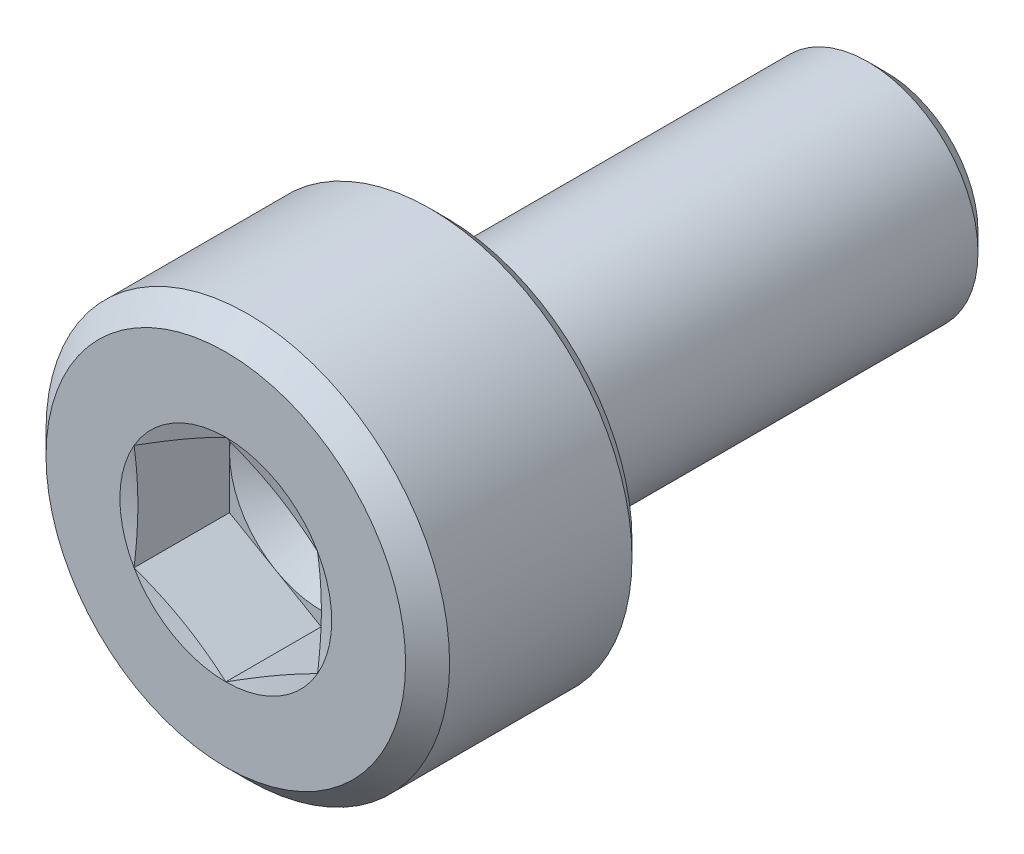
ISO-10303-21;
HEADER;
FILE_DESCRIPTION(('STEP AP214'),'2;1');
FILE_NAME('part.step','',(''),(''),'','','');
FILE_SCHEMA(('AUTOMOTIVE_DESIGN { 1 0 10303 214 1 1 1 1 }'));
ENDSEC;
DATA;
#1=APPLICATION_CONTEXT('core data for automotive mechanical design processes');
#2=APPLICATION_PROTOCOL_DEFINITION('international standard','automotive_design',2000,#1);
#3=PRODUCT_CONTEXT('',#1,'mechanical');
#4=PRODUCT('Part','Part','',(#3));
#5=PRODUCT_RELATED_PRODUCT_CATEGORY('part','',(#4));
#6=PRODUCT_DEFINITION_FORMATION('','',#4);
#7=PRODUCT_DEFINITION_CONTEXT('part definition',#1,'design');
#8=PRODUCT_DEFINITION('design','',#6,#7);
#9=PRODUCT_DEFINITION_SHAPE('','',#8);
#10=(LENGTH_UNIT() NAMED_UNIT(*) SI_UNIT(.MILLI.,.METRE.));
#11=(NAMED_UNIT(*) PLANE_ANGLE_UNIT() SI_UNIT($,.RADIAN.));
#12=(NAMED_UNIT(*) SI_UNIT($,.STERADIAN.) SOLID_ANGLE_UNIT());
#13=UNCERTAINTY_MEASURE_WITH_UNIT(LENGTH_MEASURE(1.E-05),#10,'distance_accuracy_value','');
#14=(GEOMETRIC_REPRESENTATION_CONTEXT(3) GLOBAL_UNCERTAINTY_ASSIGNED_CONTEXT((#13)) GLOBAL_UNIT_ASSIGNED_CONTEXT((#10,
#11,#12)) REPRESENTATION_CONTEXT('',''));
#15=CARTESIAN_POINT('',(0.,0.,0.));
#16=DIRECTION('',(0.,0.,1.));
#17=DIRECTION('',(1.,0.,0.));
#18=AXIS2_PLACEMENT_3D('',#15,#16,#17);
#19=CARTESIAN_POINT('',(0.,0.,0.));
#20=DIRECTION('',(0.,0.,-1.));
#21=DIRECTION('',(-1.,0.,0.));
#22=AXIS2_PLACEMENT_3D('',#19,#20,#21);
#23=PLANE('',#22);
#24=CARTESIAN_POINT('',(0.,0.,0.));
#25=DIRECTION('',(0.,0.,1.));
#26=DIRECTION('',(1.,0.,0.));
#27=AXIS2_PLACEMENT_3D('',#24,#25,#26);
#28=CIRCLE('',#27,2.44999999999999);
#29=CARTESIAN_POINT('',(2.44999999999999,0.,0.));
#30=VERTEX_POINT('',#29);
#31=EDGE_CURVE('E227',#30,#30,#28,.T.);
#32=ORIENTED_EDGE('',*,*,#31,.T.);
#33=EDGE_LOOP('',(#32));
#34=FACE_BOUND('',#33,.T.);
#35=CARTESIAN_POINT('',(0.,0.,0.));
#36=DIRECTION('',(0.,0.,1.));
#37=DIRECTION('',(1.,0.,0.));
#38=AXIS2_PLACEMENT_3D('',#35,#36,#37);
#39=CIRCLE('',#38,1.44337567297407);
#40=CARTESIAN_POINT('',(-1.25,-0.721687836487033,0.));
#41=VERTEX_POINT('',#40);
#42=CARTESIAN_POINT('',(0.,-1.44337567297407,0.));
#43=VERTEX_POINT('',#42);
#44=EDGE_CURVE('E153',#41,#43,#39,.T.);
#45=ORIENTED_EDGE('',*,*,#44,.F.);
#46=CARTESIAN_POINT('',(-1.25,0.721687836487033,0.));
#47=VERTEX_POINT('',#46);
#48=EDGE_CURVE('E152',#47,#41,#39,.T.);
#49=ORIENTED_EDGE('',*,*,#48,.F.);
#50=CARTESIAN_POINT('',(0.,1.44337567297407,0.));
#51=VERTEX_POINT('',#50);
#52=EDGE_CURVE('E119',#51,#47,#39,.T.);
#53=ORIENTED_EDGE('',*,*,#52,.F.);
#54=CARTESIAN_POINT('',(1.25,0.721687836487034,0.));
#55=VERTEX_POINT('',#54);
#56=EDGE_CURVE('E113',#55,#51,#39,.T.);
#57=ORIENTED_EDGE('',*,*,#56,.F.);
#58=CARTESIAN_POINT('',(1.25,-0.721687836487031,0.));
#59=VERTEX_POINT('',#58);
#60=EDGE_CURVE('E121',#59,#55,#39,.T.);
#61=ORIENTED_EDGE('',*,*,#60,.F.);
#62=EDGE_CURVE('E311',#43,#59,#39,.T.);
#63=ORIENTED_EDGE('',*,*,#62,.F.);
#64=EDGE_LOOP('',(#45,#49,#53,#57,#61,#63));
#65=FACE_BOUND('',#64,.T.);
#66=ADVANCED_FACE('F36',(#34,#65),#23,.F.);
#67=CARTESIAN_POINT('',(0.,0.,-0.3));
#68=DIRECTION('',(0.,0.,-1.));
#69=DIRECTION('',(-1.,0.,0.));
#70=AXIS2_PLACEMENT_3D('',#67,#68,#69);
#71=CONICAL_SURFACE('',#70,2.75,0.78539816339746);
#72=ORIENTED_EDGE('',*,*,#31,.F.);
#73=EDGE_LOOP('',(#72));
#74=FACE_BOUND('',#73,.T.);
#75=CARTESIAN_POINT('',(0.,0.,-0.3));
#76=DIRECTION('',(0.,0.,1.));
#77=DIRECTION('',(1.,0.,0.));
#78=AXIS2_PLACEMENT_3D('',#75,#76,#77);
#79=CIRCLE('',#78,2.75);
#80=CARTESIAN_POINT('',(2.75,0.,-0.3));
#81=VERTEX_POINT('',#80);
#82=EDGE_CURVE('E229',#81,#81,#79,.T.);
#83=ORIENTED_EDGE('',*,*,#82,.T.);
#84=EDGE_LOOP('',(#83));
#85=FACE_BOUND('',#84,.T.);
#86=ADVANCED_FACE('F218',(#74,#85),#71,.T.);
#87=CARTESIAN_POINT('',(0.,0.,0.));
#88=DIRECTION('',(0.,0.,1.));
#89=DIRECTION('',(1.,0.,0.));
#90=AXIS2_PLACEMENT_3D('',#87,#88,#89);
#91=CYLINDRICAL_SURFACE('',#90,2.75);
#92=ORIENTED_EDGE('',*,*,#82,.F.);
#93=EDGE_LOOP('',(#92));
#94=FACE_BOUND('',#93,.T.);
#95=CARTESIAN_POINT('',(0.,0.,-2.785));
#96=DIRECTION('',(0.,0.,1.));
#97=DIRECTION('',(1.,0.,0.));
#98=AXIS2_PLACEMENT_3D('',#95,#96,#97);
#99=CIRCLE('',#98,2.75);
#100=CARTESIAN_POINT('',(2.75,0.,-2.785));
#101=VERTEX_POINT('',#100);
#102=EDGE_CURVE('E232',#101,#101,#99,.T.);
#103=ORIENTED_EDGE('',*,*,#102,.T.);
#104=EDGE_LOOP('',(#103));
#105=FACE_BOUND('',#104,.T.);
#106=ADVANCED_FACE('F223',(#94,#105),#91,.T.);
#107=CARTESIAN_POINT('',(0.,0.,-3.));
#108=DIRECTION('',(0.,0.,1.));
#109=DIRECTION('',(1.,0.,0.));
#110=AXIS2_PLACEMENT_3D('',#107,#108,#109);
#111=CONICAL_SURFACE('',#110,2.535,0.785398163397449);
#112=ORIENTED_EDGE('',*,*,#102,.F.);
#113=EDGE_LOOP('',(#112));
#114=FACE_BOUND('',#113,.T.);
#115=CARTESIAN_POINT('',(0.,0.,-3.));
#116=DIRECTION('',(0.,0.,1.));
#117=DIRECTION('',(1.,0.,0.));
#118=AXIS2_PLACEMENT_3D('',#115,#116,#117);
#119=CIRCLE('',#118,2.535);
#120=CARTESIAN_POINT('',(2.535,0.,-3.));
#121=VERTEX_POINT('',#120);
#122=EDGE_CURVE('E237',#121,#121,#119,.T.);
#123=ORIENTED_EDGE('',*,*,#122,.T.);
#124=EDGE_LOOP('',(#123));
#125=FACE_BOUND('',#124,.T.);
#126=ADVANCED_FACE('F427',(#114,#125),#111,.T.);
#127=CARTESIAN_POINT('',(0.,2.535,-3.));
#128=DIRECTION('',(0.,0.,1.));
#129=DIRECTION('',(1.,0.,0.));
#130=AXIS2_PLACEMENT_3D('',#127,#128,#129);
#131=PLANE('',#130);
#132=ORIENTED_EDGE('',*,*,#122,.F.);
#133=EDGE_LOOP('',(#132));
#134=FACE_BOUND('',#133,.T.);
#135=CARTESIAN_POINT('',(0.,0.,-3.));
#136=DIRECTION('',(0.,0.,1.));
#137=DIRECTION('',(1.,0.,0.));
#138=AXIS2_PLACEMENT_3D('',#135,#136,#137);
#139=CIRCLE('',#138,1.8);
#140=CARTESIAN_POINT('',(1.8,0.,-3.));
#141=VERTEX_POINT('',#140);
#142=EDGE_CURVE('E240',#141,#141,#139,.T.);
#143=ORIENTED_EDGE('',*,*,#142,.T.);
#144=EDGE_LOOP('',(#143));
#145=FACE_BOUND('',#144,.T.);
#146=ADVANCED_FACE('F419',(#134,#145),#131,.F.);
#147=CARTESIAN_POINT('',(0.,0.,-3.1));
#148=DIRECTION('',(0.,0.,1.));
#149=DIRECTION('',(1.,0.,0.));
#150=AXIS2_PLACEMENT_3D('',#147,#148,#149);
#151=TOROIDAL_SURFACE('',#150,1.8,0.1);
#152=ORIENTED_EDGE('',*,*,#142,.F.);
#153=EDGE_LOOP('',(#152));
#154=FACE_BOUND('',#153,.T.);
#155=CARTESIAN_POINT('',(0.,0.,-3.05615763679786));
#156=DIRECTION('',(0.,0.,1.));
#157=DIRECTION('',(1.,0.,0.));
#158=AXIS2_PLACEMENT_3D('',#155,#156,#157);
#159=CIRCLE('',#158,1.71012315543561);
#160=CARTESIAN_POINT('',(1.71012315543561,0.,-3.05615763679786));
#161=VERTEX_POINT('',#160);
#162=EDGE_CURVE('E243',#161,#161,#159,.T.);
#163=ORIENTED_EDGE('',*,*,#162,.T.);
#164=EDGE_LOOP('',(#163));
#165=FACE_BOUND('',#164,.T.);
#166=ADVANCED_FACE('F411',(#154,#165),#151,.F.);
#167=CARTESIAN_POINT('',(0.,0.,-3.46615763679786));
#168=DIRECTION('',(0.,0.,1.));
#169=DIRECTION('',(1.,0.,0.));
#170=AXIS2_PLACEMENT_3D('',#167,#168,#169);
#171=CONICAL_SURFACE('',#170,1.51012315543561,0.453844001521511);
#172=ORIENTED_EDGE('',*,*,#162,.F.);
#173=EDGE_LOOP('',(#172));
#174=FACE_BOUND('',#173,.T.);
#175=CARTESIAN_POINT('',(0.,0.,-3.46615763679786));
#176=DIRECTION('',(0.,0.,1.));
#177=DIRECTION('',(1.,0.,0.));
#178=AXIS2_PLACEMENT_3D('',#175,#176,#177);
#179=CIRCLE('',#178,1.51012315543561);
#180=CARTESIAN_POINT('',(1.51012315543561,0.,-3.46615763679786));
#181=VERTEX_POINT('',#180);
#182=EDGE_CURVE('E246',#181,#181,#179,.T.);
#183=ORIENTED_EDGE('',*,*,#182,.T.);
#184=EDGE_LOOP('',(#183));
#185=FACE_BOUND('',#184,.T.);
#186=ADVANCED_FACE('F403',(#174,#185),#171,.T.);
#187=CARTESIAN_POINT('',(0.,0.,-3.51));
#188=DIRECTION('',(0.,0.,1.));
#189=DIRECTION('',(1.,0.,0.));
#190=AXIS2_PLACEMENT_3D('',#187,#188,#189);
#191=TOROIDAL_SURFACE('',#190,1.6,0.1);
#192=ORIENTED_EDGE('',*,*,#182,.F.);
#193=EDGE_LOOP('',(#192));
#194=FACE_BOUND('',#193,.T.);
#195=CARTESIAN_POINT('',(0.,0.,-3.51));
#196=DIRECTION('',(0.,0.,1.));
#197=DIRECTION('',(1.,0.,0.));
#198=AXIS2_PLACEMENT_3D('',#195,#196,#197);
#199=CIRCLE('',#198,1.5);
#200=CARTESIAN_POINT('',(1.5,0.,-3.51));
#201=VERTEX_POINT('',#200);
#202=EDGE_CURVE('E249',#201,#201,#199,.T.);
#203=ORIENTED_EDGE('',*,*,#202,.T.);
#204=EDGE_LOOP('',(#203));
#205=FACE_BOUND('',#204,.T.);
#206=ADVANCED_FACE('F395',(#194,#205),#191,.F.);
#207=CARTESIAN_POINT('',(0.,0.,0.));
#208=DIRECTION('',(0.,0.,1.));
#209=DIRECTION('',(1.,0.,0.));
#210=AXIS2_PLACEMENT_3D('',#207,#208,#209);
#211=CYLINDRICAL_SURFACE('',#210,1.5);
#212=ORIENTED_EDGE('',*,*,#202,.F.);
#213=EDGE_LOOP('',(#212));
#214=FACE_BOUND('',#213,.T.);
#215=CARTESIAN_POINT('',(0.,0.,-8.75));
#216=DIRECTION('',(0.,0.,1.));
#217=DIRECTION('',(1.,0.,0.));
#218=AXIS2_PLACEMENT_3D('',#215,#216,#217);
#219=CIRCLE('',#218,1.5);
#220=CARTESIAN_POINT('',(1.5,0.,-8.75));
#221=VERTEX_POINT('',#220);
#222=EDGE_CURVE('E252',#221,#221,#219,.T.);
#223=ORIENTED_EDGE('',*,*,#222,.T.);
#224=EDGE_LOOP('',(#223));
#225=FACE_BOUND('',#224,.T.);
#226=ADVANCED_FACE('F386',(#214,#225),#211,.T.);
#227=CARTESIAN_POINT('',(0.,0.,-9.));
#228=DIRECTION('',(0.,0.,1.));
#229=DIRECTION('',(1.,0.,0.));
#230=AXIS2_PLACEMENT_3D('',#227,#228,#229);
#231=CONICAL_SURFACE('',#230,1.25,0.785398163397438);
#232=ORIENTED_EDGE('',*,*,#222,.F.);
#233=EDGE_LOOP('',(#232));
#234=FACE_BOUND('',#233,.T.);
#235=CARTESIAN_POINT('',(0.,0.,-9.));
#236=DIRECTION('',(0.,0.,1.));
#237=DIRECTION('',(1.,0.,0.));
#238=AXIS2_PLACEMENT_3D('',#235,#236,#237);
#239=CIRCLE('',#238,1.25);
#240=CARTESIAN_POINT('',(1.25,0.,-9.));
#241=VERTEX_POINT('',#240);
#242=EDGE_CURVE('E255',#241,#241,#239,.T.);
#243=ORIENTED_EDGE('',*,*,#242,.T.);
#244=EDGE_LOOP('',(#243));
#245=FACE_BOUND('',#244,.T.);
#246=ADVANCED_FACE('F378',(#234,#245),#231,.T.);
#247=CARTESIAN_POINT('',(0.,1.25,-9.));
#248=DIRECTION('',(0.,0.,1.));
#249=DIRECTION('',(1.,0.,0.));
#250=AXIS2_PLACEMENT_3D('',#247,#248,#249);
#251=PLANE('',#250);
#252=ORIENTED_EDGE('',*,*,#242,.F.);
#253=EDGE_LOOP('',(#252));
#254=FACE_BOUND('',#253,.T.);
#255=ADVANCED_FACE('F372',(#254),#251,.F.);
#256=CARTESIAN_POINT('',(0.,0.,-0.0518148554092243));
#257=DIRECTION('',(0.,0.,1.));
#258=DIRECTION('',(1.,0.,0.));
#259=AXIS2_PLACEMENT_3D('',#256,#257,#258);
#260=CONICAL_SURFACE('',#259,1.25,1.30899693899575);
#261=ORIENTED_EDGE('',*,*,#52,.T.);
#262=CARTESIAN_POINT('',(-1.2502,0.721572366433195,3.09438201916871E-05));
#263=CARTESIAN_POINT('',(-1.19827409383526,0.751551802335321,-0.00800698378926622));
#264=CARTESIAN_POINT('',(-1.14625401362102,0.781585609650283,-0.0153042105125454));
#265=CARTESIAN_POINT('',(-1.04203006351459,0.841759335300235,-0.0281248924452036));
#266=CARTESIAN_POINT('',(-0.989826127596593,0.871899291755248,-0.0336476265269101));
#267=CARTESIAN_POINT('',(-0.88555111655682,0.932102497448812,-0.0425967858491088));
#268=CARTESIAN_POINT('',(-0.833480747184869,0.962165339222511,-0.0460338877791617));
#269=CARTESIAN_POINT('',(-0.729273575326724,1.0223293779463,-0.0506427032068));
#270=CARTESIAN_POINT('',(-0.677136787663362,1.05243056633842,-0.0518148554092241));
#271=CARTESIAN_POINT('',(-0.572863212336638,1.11263294312267,-0.0518148554092241));
#272=CARTESIAN_POINT('',(-0.520726424673275,1.1427341315148,-0.0506427032068001));
#273=CARTESIAN_POINT('',(-0.416519252815131,1.20289817023859,-0.0460338877791617));
#274=CARTESIAN_POINT('',(-0.36444888344318,1.23296101201229,-0.0425967858491088));
#275=CARTESIAN_POINT('',(-0.260173872403407,1.29316421770585,-0.03364762652691));
#276=CARTESIAN_POINT('',(-0.207969936485411,1.32330417416086,-0.0281248924452036));
#277=CARTESIAN_POINT('',(-0.103745986378985,1.38347789981082,-0.0153042105125453));
#278=CARTESIAN_POINT('',(-0.0517259061647358,1.41351170712578,-0.00800698378926612));
#279=CARTESIAN_POINT('',(0.00020000000000038,1.4434911430279,3.09438201918299E-05));
#280=B_SPLINE_CURVE_WITH_KNOTS('',3,(#262,#263,#264,#265,#266,#267,#268,#269,#270,#271,#272,
#273,#274,#275,#276,#277,#278,#279),.UNSPECIFIED.,.F.,.F.,(4,2,2,2,2,2,2,2,4),(0.,
0.18149525192516,0.363064167833313,0.543695584294992,0.724292010212745,0.9048884361305,
1.08551985259218,1.26708876850033,1.44858402042549),.UNSPECIFIED.);
#281=EDGE_CURVE('E11',#47,#51,#280,.T.);
#282=ORIENTED_EDGE('',*,*,#281,.T.);
#283=EDGE_LOOP('',(#261,#282));
#284=FACE_BOUND('',#283,.T.);
#285=ADVANCED_FACE('F125',(#284),#260,.F.);
#286=CARTESIAN_POINT('',(-1.25,-1.90803764372689,0.224449375411132));
#287=CARTESIAN_POINT('',(-1.25,-1.8513410457493,0.21174373926854));
#288=CARTESIAN_POINT('',(-1.25,-1.79460907964503,0.199195804458375));
#289=CARTESIAN_POINT('',(-1.25,-1.68105673477474,0.174495010900465));
#290=CARTESIAN_POINT('',(-1.25,-1.62423635229394,0.162342169249333));
#291=CARTESIAN_POINT('',(-1.25,-1.4535135757121,0.126574423752231));
#292=CARTESIAN_POINT('',(-1.25,-1.33945900339908,0.103675151182616));
#293=CARTESIAN_POINT('',(-1.25,-1.11170727260793,0.0609587630346281));
#294=CARTESIAN_POINT('',(-1.25,-0.998014548362105,0.0411184667683871));
#295=CARTESIAN_POINT('',(-1.25,-0.769948454688276,0.00583266905587686));
#296=CARTESIAN_POINT('',(-1.25,-0.655575207287998,-0.00961359741797872));
#297=CARTESIAN_POINT('',(-1.25,-0.424787181644499,-0.0341426384914952));
#298=CARTESIAN_POINT('',(-1.25,-0.308363938645654,-0.0431515305449703));
#299=CARTESIAN_POINT('',(-1.25,-0.133499226938177,-0.0502674214127566));
#300=CARTESIAN_POINT('',(-1.25,-0.0751823293286765,-0.0515734559811251));
#301=CARTESIAN_POINT('',(-1.25,0.0414593912908041,-0.0519953132862497));
#302=CARTESIAN_POINT('',(-1.25,0.0997842142946219,-0.0511111377164467));
#303=CARTESIAN_POINT('',(-1.25,0.275064939261687,-0.0452058780708578));
#304=CARTESIAN_POINT('',(-1.25,0.391917619612776,-0.0369155048717787));
#305=CARTESIAN_POINT('',(-1.25,0.624955711707257,-0.013420604100275));
#306=CARTESIAN_POINT('',(-1.25,0.741140574853819,0.00178895996036897));
#307=CARTESIAN_POINT('',(-1.25,0.965009686747211,0.0357098573203466));
#308=CARTESIAN_POINT('',(-1.25,1.07274149713457,0.0541179629895213));
#309=CARTESIAN_POINT('',(-1.25,1.28770836040789,0.0936619087242774));
#310=CARTESIAN_POINT('',(-1.25,1.39494334881407,0.114798093117207));
#311=CARTESIAN_POINT('',(-1.25,1.60905523406172,0.158897571848756));
#312=CARTESIAN_POINT('',(-1.25,1.71593205434096,0.181861233731142));
#313=CARTESIAN_POINT('',(-1.25,1.92941059122614,0.229035853527515));
#314=CARTESIAN_POINT('',(-1.25,2.0360123020935,0.253246837242345));
#315=CARTESIAN_POINT('',(-1.25,2.24796149236902,0.302300913060499));
#316=CARTESIAN_POINT('',(-1.25,2.35331096915779,0.32713541151495));
#317=CARTESIAN_POINT('',(-1.25,2.56386296226419,0.377426560036597));
#318=CARTESIAN_POINT('',(-1.25,2.66906547587909,0.402883221390532));
#319=CARTESIAN_POINT('',(-1.25,2.87922866754162,0.454224569867166));
#320=CARTESIAN_POINT('',(-1.25,2.98418948388924,0.4801086920956));
#321=CARTESIAN_POINT('',(-1.25,3.19401964928918,0.53223064686748));
#322=CARTESIAN_POINT('',(-1.25,3.29888900123911,0.558468467737611));
#323=CARTESIAN_POINT('',(-1.25,3.40372646605654,0.5848316076134));
#324=B_SPLINE_CURVE_WITH_KNOTS('',3,(#286,#287,#288,#289,#290,#291,#292,#293,#294,#295,#296,
#297,#298,#299,#300,#301,#302,#303,#304,#305,#306,#307,#308,#309,#310,#311,#312,#313,#314,#315,
#316,#317,#318,#319,#320,#321,#322,#323),.UNSPECIFIED.,.F.,.F.,(4,2,2,2,2,2,2,2,2,2,2,2,2,2,2,2,
2,2,4),(0.,0.17430798332962,0.348623499364559,0.697591208701206,1.04376859165833,
1.38988566606611,1.73991400543005,1.91487041156219,2.08982668242046,2.44096537417444,
2.79236007022679,3.12019018011378,3.44806170796195,3.77599934506425,4.10394376827983,
4.4286525086615,4.75336714400545,5.07768244044904,5.40198705941089),.UNSPECIFIED.);
#325=EDGE_CURVE('E118',#41,#47,#324,.T.);
#326=ORIENTED_EDGE('',*,*,#325,.T.);
#327=ORIENTED_EDGE('',*,*,#48,.T.);
#328=EDGE_LOOP('',(#326,#327));
#329=FACE_BOUND('',#328,.T.);
#330=ADVANCED_FACE('F359',(#329),#260,.F.);
#331=CARTESIAN_POINT('',(0.000199999999999765,-1.4434911430279,3.09438201913897E-05));
#332=CARTESIAN_POINT('',(-0.0517259061647364,-1.41351170712578,-0.0080069837892665));
#333=CARTESIAN_POINT('',(-0.103745986378985,-1.38347789981081,-0.0153042105125457));
#334=CARTESIAN_POINT('',(-0.207969936485412,-1.32330417416086,-0.028124892445204));
#335=CARTESIAN_POINT('',(-0.260173872403408,-1.29316421770585,-0.0336476265269104));
#336=CARTESIAN_POINT('',(-0.36444888344318,-1.23296101201229,-0.0425967858491091));
#337=CARTESIAN_POINT('',(-0.416519252815131,-1.20289817023859,-0.046033887779162));
#338=CARTESIAN_POINT('',(-0.520726424673276,-1.1427341315148,-0.0506427032068003));
#339=CARTESIAN_POINT('',(-0.572863212336638,-1.11263294312267,-0.0518148554092244));
#340=CARTESIAN_POINT('',(-0.677136787663362,-1.05243056633842,-0.0518148554092244));
#341=CARTESIAN_POINT('',(-0.729273575326725,-1.0223293779463,-0.0506427032068003));
#342=CARTESIAN_POINT('',(-0.833480747184869,-0.962165339222509,-0.046033887779162));
#343=CARTESIAN_POINT('',(-0.88555111655682,-0.93210249744881,-0.0425967858491091));
#344=CARTESIAN_POINT('',(-0.989826127596593,-0.871899291755246,-0.0336476265269103));
#345=CARTESIAN_POINT('',(-1.04203006351459,-0.841759335300233,-0.0281248924452038));
#346=CARTESIAN_POINT('',(-1.14625401362102,-0.781585609650282,-0.0153042105125455));
#347=CARTESIAN_POINT('',(-1.19827409383526,-0.75155180233532,-0.00800698378926632));
#348=CARTESIAN_POINT('',(-1.2502,-0.721572366433194,3.09438201915463E-05));
#349=B_SPLINE_CURVE_WITH_KNOTS('',3,(#331,#332,#333,#334,#335,#336,#337,#338,#339,#340,#341,
#342,#343,#344,#345,#346,#347,#348),.UNSPECIFIED.,.F.,.F.,(4,2,2,2,2,2,2,2,4),(0.,
0.18149525192516,0.363064167833313,0.543695584294991,0.724292010212745,0.904888436130499,
1.08551985259218,1.26708876850033,1.44858402042549),.UNSPECIFIED.);
#350=EDGE_CURVE('E161',#43,#41,#349,.T.);
#351=ORIENTED_EDGE('',*,*,#350,.T.);
#352=ORIENTED_EDGE('',*,*,#44,.T.);
#353=EDGE_LOOP('',(#351,#352));
#354=FACE_BOUND('',#353,.T.);
#355=ADVANCED_FACE('F353',(#354),#260,.F.);
#356=CARTESIAN_POINT('',(1.2502,-0.721572366433195,3.09438201914613E-05));
#357=CARTESIAN_POINT('',(1.19827409383526,-0.75155180233532,-0.00800698378926647));
#358=CARTESIAN_POINT('',(1.14625401362101,-0.781585609650283,-0.0153042105125457));
#359=CARTESIAN_POINT('',(1.04203006351459,-0.841759335300234,-0.0281248924452039));
#360=CARTESIAN_POINT('',(0.989826127596592,-0.871899291755247,-0.0336476265269103));
#361=CARTESIAN_POINT('',(0.88555111655682,-0.932102497448811,-0.042596785849109));
#362=CARTESIAN_POINT('',(0.833480747184869,-0.96216533922251,-0.046033887779162));
#363=CARTESIAN_POINT('',(0.729273575326724,-1.0223293779463,-0.0506427032068003));
#364=CARTESIAN_POINT('',(0.677136787663362,-1.05243056633842,-0.0518148554092244));
#365=CARTESIAN_POINT('',(0.572863212336637,-1.11263294312267,-0.0518148554092244));
#366=CARTESIAN_POINT('',(0.520726424673275,-1.1427341315148,-0.0506427032068003));
#367=CARTESIAN_POINT('',(0.416519252815131,-1.20289817023859,-0.046033887779162));
#368=CARTESIAN_POINT('',(0.36444888344318,-1.23296101201229,-0.042596785849109));
#369=CARTESIAN_POINT('',(0.260173872403407,-1.29316421770585,-0.0336476265269103));
#370=CARTESIAN_POINT('',(0.207969936485411,-1.32330417416086,-0.028124892445204));
#371=CARTESIAN_POINT('',(0.103745986378985,-1.38347789981081,-0.0153042105125458));
#372=CARTESIAN_POINT('',(0.0517259061647362,-1.41351170712578,-0.00800698378926656));
#373=CARTESIAN_POINT('',(-0.000200000000000036,-1.4434911430279,3.09438201914066E-05));
#374=B_SPLINE_CURVE_WITH_KNOTS('',3,(#356,#357,#358,#359,#360,#361,#362,#363,#364,#365,#366,
#367,#368,#369,#370,#371,#372,#373),.UNSPECIFIED.,.F.,.F.,(4,2,2,2,2,2,2,2,4),(0.,
0.18149525192516,0.363064167833312,0.543695584294991,0.724292010212745,0.904888436130499,
1.08551985259218,1.26708876850033,1.44858402042549),.UNSPECIFIED.);
#375=EDGE_CURVE('E181',#59,#43,#374,.T.);
#376=ORIENTED_EDGE('',*,*,#375,.T.);
#377=ORIENTED_EDGE('',*,*,#62,.T.);
#378=EDGE_LOOP('',(#376,#377));
#379=FACE_BOUND('',#378,.T.);
#380=ADVANCED_FACE('F347',(#379),#260,.F.);
#381=CARTESIAN_POINT('',(1.25,-1.90803764372689,0.224449375411132));
#382=CARTESIAN_POINT('',(1.25,-1.8513410457493,0.21174373926854));
#383=CARTESIAN_POINT('',(1.25,-1.79460907964503,0.199195804458375));
#384=CARTESIAN_POINT('',(1.25,-1.68105673477474,0.174495010900465));
#385=CARTESIAN_POINT('',(1.25,-1.62423635229394,0.162342169249333));
#386=CARTESIAN_POINT('',(1.25,-1.4535135757121,0.126574423752231));
#387=CARTESIAN_POINT('',(1.25,-1.33945900339908,0.103675151182616));
#388=CARTESIAN_POINT('',(1.25,-1.11170727260793,0.0609587630346278));
#389=CARTESIAN_POINT('',(1.25,-0.998014548362105,0.0411184667683869));
#390=CARTESIAN_POINT('',(1.25,-0.769948454688276,0.00583266905587672));
#391=CARTESIAN_POINT('',(1.25,-0.655575207287999,-0.00961359741797884));
#392=CARTESIAN_POINT('',(1.25,-0.4247871816445,-0.0341426384914953));
#393=CARTESIAN_POINT('',(1.25,-0.308363938645655,-0.0431515305449704));
#394=CARTESIAN_POINT('',(1.25,-0.133499226938178,-0.0502674214127568));
#395=CARTESIAN_POINT('',(1.25,-0.0751823293286781,-0.0515734559811252));
#396=CARTESIAN_POINT('',(1.25,0.0414593912908024,-0.0519953132862499));
#397=CARTESIAN_POINT('',(1.25,0.0997842142946203,-0.0511111377164469));
#398=CARTESIAN_POINT('',(1.25,0.275064939261685,-0.045205878070858));
#399=CARTESIAN_POINT('',(1.25,0.391917619612775,-0.036915504871779));
#400=CARTESIAN_POINT('',(1.25,0.624955711707256,-0.0134206041002753));
#401=CARTESIAN_POINT('',(1.25,0.741140574853817,0.00178895996036867));
#402=CARTESIAN_POINT('',(1.25,0.96500968674721,0.0357098573203462));
#403=CARTESIAN_POINT('',(1.25,1.07274149713457,0.054117962989521));
#404=CARTESIAN_POINT('',(1.25,1.28770836040789,0.093661908724277));
#405=CARTESIAN_POINT('',(1.25,1.39494334881407,0.114798093117207));
#406=CARTESIAN_POINT('',(1.25,1.60905523406172,0.158897571848756));
#407=CARTESIAN_POINT('',(1.25,1.71593205434096,0.181861233731142));
#408=CARTESIAN_POINT('',(1.25,1.92941059122614,0.229035853527516));
#409=CARTESIAN_POINT('',(1.25,2.0360123020935,0.253246837242345));
#410=CARTESIAN_POINT('',(1.25,2.24796149236902,0.302300913060499));
#411=CARTESIAN_POINT('',(1.25,2.35331096915779,0.32713541151495));
#412=CARTESIAN_POINT('',(1.25,2.56386296226419,0.377426560036597));
#413=CARTESIAN_POINT('',(1.25,2.66906547587909,0.402883221390532));
#414=CARTESIAN_POINT('',(1.25,2.87922866754162,0.454224569867166));
#415=CARTESIAN_POINT('',(1.25,2.98418948388924,0.4801086920956));
#416=CARTESIAN_POINT('',(1.25,3.19401964928918,0.53223064686748));
#417=CARTESIAN_POINT('',(1.25,3.29888900123911,0.558468467737611));
#418=CARTESIAN_POINT('',(1.25,3.40372646605654,0.5848316076134));
#419=B_SPLINE_CURVE_WITH_KNOTS('',3,(#381,#382,#383,#384,#385,#386,#387,#388,#389,#390,#391,
#392,#393,#394,#395,#396,#397,#398,#399,#400,#401,#402,#403,#404,#405,#406,#407,#408,#409,#410,
#411,#412,#413,#414,#415,#416,#417,#418),.UNSPECIFIED.,.F.,.F.,(4,2,2,2,2,2,2,2,2,2,2,2,2,2,2,2,
2,2,4),(0.,0.17430798332962,0.348623499364559,0.697591208701206,1.04376859165833,
1.38988566606611,1.73991400543005,1.91487041156219,2.08982668242046,2.44096537417444,
2.79236007022679,3.12019018011378,3.44806170796195,3.77599934506425,4.10394376827983,
4.4286525086615,4.75336714400545,5.07768244044904,5.40198705941089),.UNSPECIFIED.);
#420=EDGE_CURVE('E61',#55,#59,#419,.F.);
#421=ORIENTED_EDGE('',*,*,#420,.T.);
#422=ORIENTED_EDGE('',*,*,#60,.T.);
#423=EDGE_LOOP('',(#421,#422));
#424=FACE_BOUND('',#423,.T.);
#425=ADVANCED_FACE('F174',(#424),#260,.F.);
#426=CARTESIAN_POINT('',(-0.000199999999999885,1.4434911430279,3.09438201917452E-05));
#427=CARTESIAN_POINT('',(0.0517259061647365,1.41351170712578,-0.00800698378926616));
#428=CARTESIAN_POINT('',(0.103745986378985,1.38347789981081,-0.0153042105125454));
#429=CARTESIAN_POINT('',(0.207969936485411,1.32330417416086,-0.0281248924452036));
#430=CARTESIAN_POINT('',(0.260173872403408,1.29316421770585,-0.03364762652691));
#431=CARTESIAN_POINT('',(0.36444888344318,1.23296101201229,-0.0425967858491087));
#432=CARTESIAN_POINT('',(0.416519252815131,1.20289817023859,-0.0460338877791617));
#433=CARTESIAN_POINT('',(0.520726424673275,1.1427341315148,-0.0506427032068));
#434=CARTESIAN_POINT('',(0.572863212336638,1.11263294312267,-0.0518148554092241));
#435=CARTESIAN_POINT('',(0.677136787663362,1.05243056633842,-0.0518148554092242));
#436=CARTESIAN_POINT('',(0.729273575326724,1.0223293779463,-0.0506427032068001));
#437=CARTESIAN_POINT('',(0.833480747184869,0.962165339222511,-0.0460338877791617));
#438=CARTESIAN_POINT('',(0.88555111655682,0.932102497448812,-0.0425967858491088));
#439=CARTESIAN_POINT('',(0.989826127596592,0.871899291755248,-0.0336476265269101));
#440=CARTESIAN_POINT('',(1.04203006351459,0.841759335300235,-0.0281248924452037));
#441=CARTESIAN_POINT('',(1.14625401362101,0.781585609650283,-0.0153042105125454));
#442=CARTESIAN_POINT('',(1.19827409383526,0.751551802335321,-0.00800698378926624));
#443=CARTESIAN_POINT('',(1.2502,0.721572366433195,3.09438201916591E-05));
#444=B_SPLINE_CURVE_WITH_KNOTS('',3,(#426,#427,#428,#429,#430,#431,#432,#433,#434,#435,#436,
#437,#438,#439,#440,#441,#442,#443),.UNSPECIFIED.,.F.,.F.,(4,2,2,2,2,2,2,2,4),(0.,
0.18149525192516,0.363064167833313,0.543695584294991,0.724292010212745,0.904888436130499,
1.08551985259218,1.26708876850033,1.44858402042549),.UNSPECIFIED.);
#445=EDGE_CURVE('E55',#51,#55,#444,.T.);
#446=ORIENTED_EDGE('',*,*,#445,.T.);
#447=ORIENTED_EDGE('',*,*,#56,.T.);
#448=EDGE_LOOP('',(#446,#447));
#449=FACE_BOUND('',#448,.T.);
#450=ADVANCED_FACE('F114',(#449),#260,.F.);
#451=CARTESIAN_POINT('',(0.,0.,-2.02168783648703));
#452=DIRECTION('',(0.,0.,1.));
#453=DIRECTION('',(1.,0.,0.));
#454=AXIS2_PLACEMENT_3D('',#451,#452,#453);
#455=CONICAL_SURFACE('',#454,0.,1.0471975511966);
#456=CARTESIAN_POINT('',(0.,0.,-1.3));
#457=DIRECTION('',(0.,0.,1.));
#458=DIRECTION('',(1.,0.,0.));
#459=AXIS2_PLACEMENT_3D('',#456,#457,#458);
#460=CIRCLE('',#459,1.25);
#461=CARTESIAN_POINT('',(1.25,0.,-1.3));
#462=VERTEX_POINT('',#461);
#463=CARTESIAN_POINT('',(0.625,1.08253175473055,-1.3));
#464=VERTEX_POINT('',#463);
#465=EDGE_CURVE('E141',#462,#464,#460,.T.);
#466=ORIENTED_EDGE('',*,*,#465,.T.);
#467=CARTESIAN_POINT('',(-0.625,1.08253175473055,-1.3));
#468=VERTEX_POINT('',#467);
#469=EDGE_CURVE('E49',#464,#468,#460,.T.);
#470=ORIENTED_EDGE('',*,*,#469,.T.);
#471=CARTESIAN_POINT('',(-1.25,0.,-1.3));
#472=VERTEX_POINT('',#471);
#473=EDGE_CURVE('E292',#468,#472,#460,.T.);
#474=ORIENTED_EDGE('',*,*,#473,.T.);
#475=CARTESIAN_POINT('',(-0.625,-1.08253175473055,-1.3));
#476=VERTEX_POINT('',#475);
#477=EDGE_CURVE('E294',#472,#476,#460,.T.);
#478=ORIENTED_EDGE('',*,*,#477,.T.);
#479=CARTESIAN_POINT('',(0.624999999999999,-1.08253175473055,-1.3));
#480=VERTEX_POINT('',#479);
#481=EDGE_CURVE('E230',#476,#480,#460,.T.);
#482=ORIENTED_EDGE('',*,*,#481,.T.);
#483=EDGE_CURVE('E228',#480,#462,#460,.T.);
#484=ORIENTED_EDGE('',*,*,#483,.T.);
#485=EDGE_LOOP('',(#466,#470,#474,#478,#482,#484));
#486=FACE_BOUND('',#485,.T.);
#487=CARTESIAN_POINT('',(0.,0.,-2.02168783648703));
#488=VERTEX_POINT('',#487);
#489=VERTEX_LOOP('',#488);
#490=FACE_BOUND('',#489,.T.);
#491=ADVANCED_FACE('F173',(#486,#490),#455,.F.);
#492=CARTESIAN_POINT('',(0.,0.,-1.3));
#493=DIRECTION('',(0.,0.,1.));
#494=DIRECTION('',(1.,0.,0.));
#495=AXIS2_PLACEMENT_3D('',#492,#493,#494);
#496=PLANE('',#495);
#497=ORIENTED_EDGE('',*,*,#465,.F.);
#498=DIRECTION('',(0.,1.,0.));
#499=VECTOR('',#498,1.);
#500=CARTESIAN_POINT('',(1.25,-0.721687836487033,-1.3));
#501=LINE('',#500,#499);
#502=CARTESIAN_POINT('',(1.25,0.721687836487033,-1.3));
#503=VERTEX_POINT('',#502);
#504=EDGE_CURVE('E271',#462,#503,#501,.T.);
#505=ORIENTED_EDGE('',*,*,#504,.T.);
#506=DIRECTION('',(-0.866025403784439,0.5,0.));
#507=VECTOR('',#506,1.);
#508=CARTESIAN_POINT('',(1.25,0.721687836487033,-1.3));
#509=LINE('',#508,#507);
#510=EDGE_CURVE('E286',#503,#464,#509,.T.);
#511=ORIENTED_EDGE('',*,*,#510,.T.);
#512=EDGE_LOOP('',(#497,#505,#511));
#513=FACE_BOUND('',#512,.T.);
#514=ADVANCED_FACE('F316',(#513),#496,.T.);
#515=ORIENTED_EDGE('',*,*,#483,.F.);
#516=DIRECTION('',(0.866025403784439,0.5,0.));
#517=VECTOR('',#516,1.);
#518=CARTESIAN_POINT('',(0.,-1.44337567297406,-1.3));
#519=LINE('',#518,#517);
#520=CARTESIAN_POINT('',(1.25,-0.721687836487033,-1.3));
#521=VERTEX_POINT('',#520);
#522=EDGE_CURVE('E275',#480,#521,#519,.T.);
#523=ORIENTED_EDGE('',*,*,#522,.T.);
#524=EDGE_CURVE('E148',#521,#462,#501,.T.);
#525=ORIENTED_EDGE('',*,*,#524,.T.);
#526=EDGE_LOOP('',(#515,#523,#525));
#527=FACE_BOUND('',#526,.T.);
#528=ADVANCED_FACE('F204',(#527),#496,.T.);
#529=ORIENTED_EDGE('',*,*,#481,.F.);
#530=DIRECTION('',(0.866025403784439,-0.5,0.));
#531=VECTOR('',#530,1.);
#532=CARTESIAN_POINT('',(-1.25,-0.721687836487032,-1.3));
#533=LINE('',#532,#531);
#534=CARTESIAN_POINT('',(0.,-1.44337567297406,-1.3));
#535=VERTEX_POINT('',#534);
#536=EDGE_CURVE('E279',#476,#535,#533,.T.);
#537=ORIENTED_EDGE('',*,*,#536,.T.);
#538=EDGE_CURVE('E272',#535,#480,#519,.T.);
#539=ORIENTED_EDGE('',*,*,#538,.T.);
#540=EDGE_LOOP('',(#529,#537,#539));
#541=FACE_BOUND('',#540,.T.);
#542=ADVANCED_FACE('F307',(#541),#496,.T.);
#543=ORIENTED_EDGE('',*,*,#477,.F.);
#544=DIRECTION('',(0.,-1.,0.));
#545=VECTOR('',#544,1.);
#546=CARTESIAN_POINT('',(-1.25,0.721687836487033,-1.3));
#547=LINE('',#546,#545);
#548=CARTESIAN_POINT('',(-1.25,-0.721687836487032,-1.3));
#549=VERTEX_POINT('',#548);
#550=EDGE_CURVE('E283',#472,#549,#547,.T.);
#551=ORIENTED_EDGE('',*,*,#550,.T.);
#552=EDGE_CURVE('E276',#549,#476,#533,.T.);
#553=ORIENTED_EDGE('',*,*,#552,.T.);
#554=EDGE_LOOP('',(#543,#551,#553));
#555=FACE_BOUND('',#554,.T.);
#556=ADVANCED_FACE('F321',(#555),#496,.T.);
#557=ORIENTED_EDGE('',*,*,#469,.F.);
#558=CARTESIAN_POINT('',(0.,1.44337567297407,-1.3));
#559=VERTEX_POINT('',#558);
#560=EDGE_CURVE('E288',#464,#559,#509,.T.);
#561=ORIENTED_EDGE('',*,*,#560,.T.);
#562=DIRECTION('',(-0.866025403784439,-0.5,0.));
#563=VECTOR('',#562,1.);
#564=CARTESIAN_POINT('',(0.,1.44337567297407,-1.3));
#565=LINE('',#564,#563);
#566=EDGE_CURVE('E146',#559,#468,#565,.T.);
#567=ORIENTED_EDGE('',*,*,#566,.T.);
#568=EDGE_LOOP('',(#557,#561,#567));
#569=FACE_BOUND('',#568,.T.);
#570=ADVANCED_FACE('F318',(#569),#496,.T.);
#571=ORIENTED_EDGE('',*,*,#473,.F.);
#572=CARTESIAN_POINT('',(-1.25,0.721687836487033,-1.3));
#573=VERTEX_POINT('',#572);
#574=EDGE_CURVE('E285',#468,#573,#565,.T.);
#575=ORIENTED_EDGE('',*,*,#574,.T.);
#576=EDGE_CURVE('E280',#573,#472,#547,.T.);
#577=ORIENTED_EDGE('',*,*,#576,.T.);
#578=EDGE_LOOP('',(#571,#575,#577));
#579=FACE_BOUND('',#578,.T.);
#580=ADVANCED_FACE('F320',(#579),#496,.T.);
#581=CARTESIAN_POINT('',(0.,1.44337567297407,-1.3));
#582=DIRECTION('',(-0.5,0.866025403784439,0.));
#583=DIRECTION('',(-0.866025403784439,-0.5,0.));
#584=AXIS2_PLACEMENT_3D('',#581,#582,#583);
#585=PLANE('',#584);
#586=ORIENTED_EDGE('',*,*,#281,.F.);
#587=DIRECTION('',(0.,0.,1.));
#588=VECTOR('',#587,1.);
#589=CARTESIAN_POINT('',(-1.25,0.721687836487033,-1.3));
#590=LINE('',#589,#588);
#591=EDGE_CURVE('E147',#573,#47,#590,.T.);
#592=ORIENTED_EDGE('',*,*,#591,.F.);
#593=ORIENTED_EDGE('',*,*,#574,.F.);
#594=ORIENTED_EDGE('',*,*,#566,.F.);
#595=DIRECTION('',(0.,0.,1.));
#596=VECTOR('',#595,1.);
#597=CARTESIAN_POINT('',(0.,1.44337567297407,-1.3));
#598=LINE('',#597,#596);
#599=EDGE_CURVE('E136',#559,#51,#598,.T.);
#600=ORIENTED_EDGE('',*,*,#599,.T.);
#601=EDGE_LOOP('',(#586,#592,#593,#594,#600));
#602=FACE_BOUND('',#601,.T.);
#603=ADVANCED_FACE('F143',(#602),#585,.F.);
#604=CARTESIAN_POINT('',(-1.25,0.721687836487033,-1.3));
#605=DIRECTION('',(-1.,0.,0.));
#606=DIRECTION('',(0.,0.,1.));
#607=AXIS2_PLACEMENT_3D('',#604,#605,#606);
#608=PLANE('',#607);
#609=ORIENTED_EDGE('',*,*,#325,.F.);
#610=DIRECTION('',(0.,0.,1.));
#611=VECTOR('',#610,1.);
#612=CARTESIAN_POINT('',(-1.25,-0.721687836487032,-1.3));
#613=LINE('',#612,#611);
#614=EDGE_CURVE('E259',#549,#41,#613,.T.);
#615=ORIENTED_EDGE('',*,*,#614,.F.);
#616=ORIENTED_EDGE('',*,*,#550,.F.);
#617=ORIENTED_EDGE('',*,*,#576,.F.);
#618=ORIENTED_EDGE('',*,*,#591,.T.);
#619=EDGE_LOOP('',(#609,#615,#616,#617,#618));
#620=FACE_BOUND('',#619,.T.);
#621=ADVANCED_FACE('F168',(#620),#608,.F.);
#622=CARTESIAN_POINT('',(-1.25,-0.721687836487032,-1.3));
#623=DIRECTION('',(-0.5,-0.866025403784439,0.));
#624=DIRECTION('',(0.866025403784439,-0.5,0.));
#625=AXIS2_PLACEMENT_3D('',#622,#623,#624);
#626=PLANE('',#625);
#627=ORIENTED_EDGE('',*,*,#350,.F.);
#628=DIRECTION('',(0.,0.,1.));
#629=VECTOR('',#628,1.);
#630=CARTESIAN_POINT('',(0.,-1.44337567297406,-1.3));
#631=LINE('',#630,#629);
#632=EDGE_CURVE('E262',#535,#43,#631,.T.);
#633=ORIENTED_EDGE('',*,*,#632,.F.);
#634=ORIENTED_EDGE('',*,*,#536,.F.);
#635=ORIENTED_EDGE('',*,*,#552,.F.);
#636=ORIENTED_EDGE('',*,*,#614,.T.);
#637=EDGE_LOOP('',(#627,#633,#634,#635,#636));
#638=FACE_BOUND('',#637,.T.);
#639=ADVANCED_FACE('F207',(#638),#626,.F.);
#640=CARTESIAN_POINT('',(0.,-1.44337567297406,-1.3));
#641=DIRECTION('',(0.5,-0.866025403784439,0.));
#642=DIRECTION('',(0.866025403784439,0.5,0.));
#643=AXIS2_PLACEMENT_3D('',#640,#641,#642);
#644=PLANE('',#643);
#645=ORIENTED_EDGE('',*,*,#375,.F.);
#646=DIRECTION('',(0.,0.,1.));
#647=VECTOR('',#646,1.);
#648=CARTESIAN_POINT('',(1.25,-0.721687836487033,-1.3));
#649=LINE('',#648,#647);
#650=EDGE_CURVE('E265',#521,#59,#649,.T.);
#651=ORIENTED_EDGE('',*,*,#650,.F.);
#652=ORIENTED_EDGE('',*,*,#522,.F.);
#653=ORIENTED_EDGE('',*,*,#538,.F.);
#654=ORIENTED_EDGE('',*,*,#632,.T.);
#655=EDGE_LOOP('',(#645,#651,#652,#653,#654));
#656=FACE_BOUND('',#655,.T.);
#657=ADVANCED_FACE('F202',(#656),#644,.F.);
#658=CARTESIAN_POINT('',(1.25,-0.721687836487033,-1.3));
#659=DIRECTION('',(1.,0.,0.));
#660=DIRECTION('',(0.,1.,0.));
#661=AXIS2_PLACEMENT_3D('',#658,#659,#660);
#662=PLANE('',#661);
#663=ORIENTED_EDGE('',*,*,#420,.F.);
#664=DIRECTION('',(0.,0.,1.));
#665=VECTOR('',#664,1.);
#666=CARTESIAN_POINT('',(1.25,0.721687836487033,-1.3));
#667=LINE('',#666,#665);
#668=EDGE_CURVE('E140',#503,#55,#667,.T.);
#669=ORIENTED_EDGE('',*,*,#668,.F.);
#670=ORIENTED_EDGE('',*,*,#504,.F.);
#671=ORIENTED_EDGE('',*,*,#524,.F.);
#672=ORIENTED_EDGE('',*,*,#650,.T.);
#673=EDGE_LOOP('',(#663,#669,#670,#671,#672));
#674=FACE_BOUND('',#673,.T.);
#675=ADVANCED_FACE('F199',(#674),#662,.F.);
#676=CARTESIAN_POINT('',(1.25,0.721687836487033,-1.3));
#677=DIRECTION('',(0.5,0.866025403784439,0.));
#678=DIRECTION('',(-0.866025403784439,0.5,0.));
#679=AXIS2_PLACEMENT_3D('',#676,#677,#678);
#680=PLANE('',#679);
#681=ORIENTED_EDGE('',*,*,#445,.F.);
#682=ORIENTED_EDGE('',*,*,#599,.F.);
#683=ORIENTED_EDGE('',*,*,#560,.F.);
#684=ORIENTED_EDGE('',*,*,#510,.F.);
#685=ORIENTED_EDGE('',*,*,#668,.T.);
#686=EDGE_LOOP('',(#681,#682,#683,#684,#685));
#687=FACE_BOUND('',#686,.T.);
#688=ADVANCED_FACE('F134',(#687),#680,.F.);
#689=CLOSED_SHELL('',(#66,#86,#106,#126,#146,#166,#186,#206,#226,#246,#255,#285,#330,#355,#380,
#425,#450,#491,#514,#528,#542,#556,#570,#580,#603,#621,#639,#657,#675,#688));
#690=MANIFOLD_SOLID_BREP('B2',#689);
#691=ADVANCED_BREP_SHAPE_REPRESENTATION('',(#18,#690),#14);
#692=SHAPE_DEFINITION_REPRESENTATION(#9,#691);
ENDSEC;
END-ISO-10303-21;
